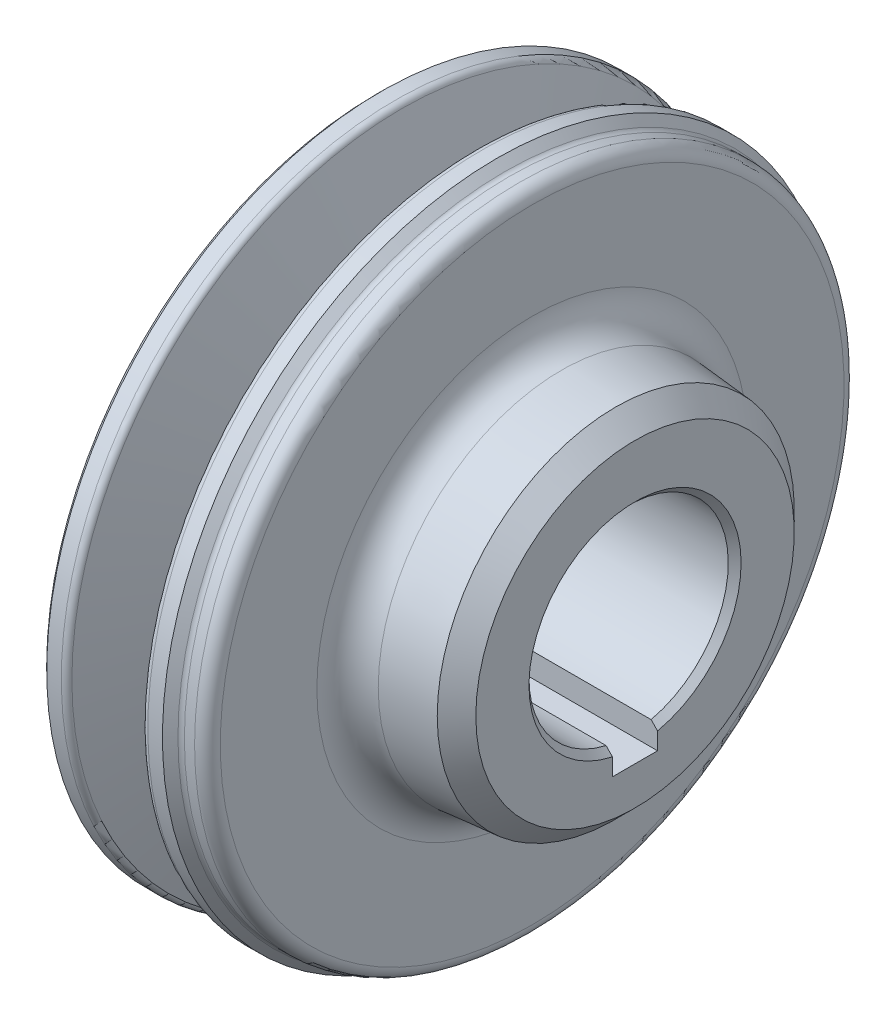
ISO-10303-21;
HEADER;
FILE_DESCRIPTION(('STEP AP214'),'2;1');
FILE_NAME('part.step','',(''),(''),'','','');
FILE_SCHEMA(('AUTOMOTIVE_DESIGN { 1 0 10303 214 1 1 1 1 }'));
ENDSEC;
DATA;
#1=APPLICATION_CONTEXT('core data for automotive mechanical design processes');
#2=APPLICATION_PROTOCOL_DEFINITION('international standard','automotive_design',2000,#1);
#3=PRODUCT_CONTEXT('',#1,'mechanical');
#4=PRODUCT('Part','Part','',(#3));
#5=PRODUCT_RELATED_PRODUCT_CATEGORY('part','',(#4));
#6=PRODUCT_DEFINITION_FORMATION('','',#4);
#7=PRODUCT_DEFINITION_CONTEXT('part definition',#1,'design');
#8=PRODUCT_DEFINITION('design','',#6,#7);
#9=PRODUCT_DEFINITION_SHAPE('','',#8);
#10=(LENGTH_UNIT() NAMED_UNIT(*) SI_UNIT(.MILLI.,.METRE.));
#11=(NAMED_UNIT(*) PLANE_ANGLE_UNIT() SI_UNIT($,.RADIAN.));
#12=(NAMED_UNIT(*) SI_UNIT($,.STERADIAN.) SOLID_ANGLE_UNIT());
#13=UNCERTAINTY_MEASURE_WITH_UNIT(LENGTH_MEASURE(1.E-05),#10,'distance_accuracy_value','');
#14=(GEOMETRIC_REPRESENTATION_CONTEXT(3) GLOBAL_UNCERTAINTY_ASSIGNED_CONTEXT((#13)) GLOBAL_UNIT_ASSIGNED_CONTEXT((#10,
#11,#12)) REPRESENTATION_CONTEXT('',''));
#15=CARTESIAN_POINT('',(0.,0.,0.));
#16=DIRECTION('',(0.,0.,1.));
#17=DIRECTION('',(1.,0.,0.));
#18=AXIS2_PLACEMENT_3D('',#15,#16,#17);
#19=CARTESIAN_POINT('',(-225.5,0.,0.));
#20=DIRECTION('',(1.,0.,0.));
#21=DIRECTION('',(0.,-1.,0.));
#22=AXIS2_PLACEMENT_3D('',#19,#20,#21);
#23=TOROIDAL_SURFACE('',#22,50.58578643763,1.);
#24=CARTESIAN_POINT('',(-226.207106781203,0.,0.));
#25=DIRECTION('',(1.,0.,0.));
#26=DIRECTION('',(0.,-1.,0.));
#27=AXIS2_PLACEMENT_3D('',#24,#25,#26);
#28=CIRCLE('',#27,51.292893218772);
#29=CARTESIAN_POINT('',(-226.207106781203,-51.292893218772,0.));
#30=VERTEX_POINT('',#29);
#31=EDGE_CURVE('E348',#30,#30,#28,.T.);
#32=ORIENTED_EDGE('',*,*,#31,.F.);
#33=EDGE_LOOP('',(#32));
#34=FACE_BOUND('',#33,.T.);
#35=CARTESIAN_POINT('',(-226.5,0.,0.));
#36=DIRECTION('',(1.,0.,0.));
#37=DIRECTION('',(0.,1.,0.));
#38=AXIS2_PLACEMENT_3D('',#35,#36,#37);
#39=CIRCLE('',#38,50.58578643763);
#40=CARTESIAN_POINT('',(-226.5,50.58578643763,0.));
#41=VERTEX_POINT('',#40);
#42=CARTESIAN_POINT('',(-226.5,-50.58578643763,0.));
#43=VERTEX_POINT('',#42);
#44=EDGE_CURVE('E355',#41,#43,#39,.T.);
#45=ORIENTED_EDGE('',*,*,#44,.T.);
#46=CARTESIAN_POINT('',(-226.5,0.,0.));
#47=DIRECTION('',(1.,0.,0.));
#48=DIRECTION('',(0.,-1.,0.));
#49=AXIS2_PLACEMENT_3D('',#46,#47,#48);
#50=CIRCLE('',#49,50.58578643763);
#51=EDGE_CURVE('E307',#43,#41,#50,.T.);
#52=ORIENTED_EDGE('',*,*,#51,.T.);
#53=EDGE_LOOP('',(#45,#52));
#54=FACE_BOUND('',#53,.T.);
#55=ADVANCED_FACE('F16',(#34,#54),#23,.T.);
#56=CARTESIAN_POINT('',(-226.5,0.,0.));
#57=DIRECTION('',(1.,0.,0.));
#58=DIRECTION('',(0.,0.,-1.));
#59=AXIS2_PLACEMENT_3D('',#56,#57,#58);
#60=PLANE('',#59);
#61=CARTESIAN_POINT('',(-226.5,0.,0.));
#62=DIRECTION('',(-1.,0.,0.));
#63=DIRECTION('',(0.,-1.,0.));
#64=AXIS2_PLACEMENT_3D('',#61,#62,#63);
#65=CIRCLE('',#64,46.91491496572);
#66=CARTESIAN_POINT('',(-226.5,-46.91491496572,0.));
#67=VERTEX_POINT('',#66);
#68=CARTESIAN_POINT('',(-226.5,46.91491496572,0.));
#69=VERTEX_POINT('',#68);
#70=EDGE_CURVE('E302',#67,#69,#65,.T.);
#71=ORIENTED_EDGE('',*,*,#70,.F.);
#72=CARTESIAN_POINT('',(-226.5,0.,0.));
#73=DIRECTION('',(-1.,0.,0.));
#74=DIRECTION('',(0.,1.,0.));
#75=AXIS2_PLACEMENT_3D('',#72,#73,#74);
#76=CIRCLE('',#75,46.91491496572);
#77=EDGE_CURVE('E273',#69,#67,#76,.T.);
#78=ORIENTED_EDGE('',*,*,#77,.F.);
#79=EDGE_LOOP('',(#71,#78));
#80=FACE_BOUND('',#79,.T.);
#81=ORIENTED_EDGE('',*,*,#51,.F.);
#82=ORIENTED_EDGE('',*,*,#44,.F.);
#83=EDGE_LOOP('',(#81,#82));
#84=FACE_BOUND('',#83,.T.);
#85=ADVANCED_FACE('F312',(#80,#84),#60,.F.);
#86=CARTESIAN_POINT('',(-225.499999999954,0.,0.));
#87=DIRECTION('',(1.,0.,0.));
#88=DIRECTION('',(0.,0.,-1.));
#89=AXIS2_PLACEMENT_3D('',#86,#87,#88);
#90=CONICAL_SURFACE('',#89,52.0000000000209,0.785398163357254);
#91=CARTESIAN_POINT('',(-225.5,0.,0.));
#92=DIRECTION('',(1.,0.,0.));
#93=DIRECTION('',(0.,0.,-1.));
#94=AXIS2_PLACEMENT_3D('',#91,#92,#93);
#95=CIRCLE('',#94,52.);
#96=CARTESIAN_POINT('',(-225.5,0.,-52.));
#97=VERTEX_POINT('',#96);
#98=EDGE_CURVE('E299',#97,#97,#95,.T.);
#99=ORIENTED_EDGE('',*,*,#98,.F.);
#100=EDGE_LOOP('',(#99));
#101=FACE_BOUND('',#100,.T.);
#102=ORIENTED_EDGE('',*,*,#31,.T.);
#103=EDGE_LOOP('',(#102));
#104=FACE_BOUND('',#103,.T.);
#105=ADVANCED_FACE('F290',(#101,#104),#90,.T.);
#106=CARTESIAN_POINT('',(-225.5,0.,0.));
#107=DIRECTION('',(1.,0.,0.));
#108=DIRECTION('',(0.,-1.,0.));
#109=AXIS2_PLACEMENT_3D('',#106,#107,#108);
#110=TOROIDAL_SURFACE('',#109,46.91491496572,1.);
#111=ORIENTED_EDGE('',*,*,#77,.T.);
#112=ORIENTED_EDGE('',*,*,#70,.T.);
#113=EDGE_LOOP('',(#111,#112));
#114=FACE_BOUND('',#113,.T.);
#115=CARTESIAN_POINT('',(-225.736471925201,0.,0.));
#116=DIRECTION('',(1.,0.,0.));
#117=DIRECTION('',(0.,-1.,0.));
#118=AXIS2_PLACEMENT_3D('',#115,#116,#117);
#119=CIRCLE('',#118,45.9432766438079);
#120=CARTESIAN_POINT('',(-225.736471925201,-45.9432766438079,0.));
#121=VERTEX_POINT('',#120);
#122=EDGE_CURVE('E297',#121,#121,#119,.T.);
#123=ORIENTED_EDGE('',*,*,#122,.T.);
#124=EDGE_LOOP('',(#123));
#125=FACE_BOUND('',#124,.T.);
#126=ADVANCED_FACE('F278',(#114,#125),#110,.T.);
#127=CARTESIAN_POINT('',(-228.525,0.,0.));
#128=DIRECTION('',(1.,0.,0.));
#129=DIRECTION('',(0.,0.,-1.));
#130=AXIS2_PLACEMENT_3D('',#127,#128,#129);
#131=CYLINDRICAL_SURFACE('',#130,52.);
#132=CARTESIAN_POINT('',(-223.226542528,0.,0.));
#133=DIRECTION('',(1.,0.,0.));
#134=DIRECTION('',(0.,-1.,0.));
#135=AXIS2_PLACEMENT_3D('',#132,#133,#134);
#136=CIRCLE('',#135,52.);
#137=CARTESIAN_POINT('',(-223.226542528,-52.,0.));
#138=VERTEX_POINT('',#137);
#139=EDGE_CURVE('E718',#138,#138,#136,.T.);
#140=ORIENTED_EDGE('',*,*,#139,.F.);
#141=EDGE_LOOP('',(#140));
#142=FACE_BOUND('',#141,.T.);
#143=ORIENTED_EDGE('',*,*,#98,.T.);
#144=EDGE_LOOP('',(#143));
#145=FACE_BOUND('',#144,.T.);
#146=ADVANCED_FACE('F289',(#142,#145),#131,.T.);
#147=CARTESIAN_POINT('',(-226.2094157756,0.,0.));
#148=DIRECTION('',(1.,0.,0.));
#149=DIRECTION('',(0.,-1.,0.));
#150=AXIS2_PLACEMENT_3D('',#147,#148,#149);
#151=TOROIDAL_SURFACE('',#150,44.,2.);
#152=ORIENTED_EDGE('',*,*,#122,.F.);
#153=EDGE_LOOP('',(#152));
#154=FACE_BOUND('',#153,.T.);
#155=CARTESIAN_POINT('',(-224.307302742943,0.,0.));
#156=DIRECTION('',(-1.,0.,0.));
#157=DIRECTION('',(0.,1.,0.));
#158=AXIS2_PLACEMENT_3D('',#155,#156,#157);
#159=CIRCLE('',#158,44.6180339887974);
#160=CARTESIAN_POINT('',(-224.307302742943,44.6180339887974,0.));
#161=VERTEX_POINT('',#160);
#162=EDGE_CURVE('E720',#161,#161,#159,.F.);
#163=ORIENTED_EDGE('',*,*,#162,.T.);
#164=EDGE_LOOP('',(#163));
#165=FACE_BOUND('',#164,.T.);
#166=ADVANCED_FACE('F654',(#154,#165),#151,.F.);
#167=CARTESIAN_POINT('',(-223.226542528,0.,0.));
#168=DIRECTION('',(1.,0.,0.));
#169=DIRECTION('',(0.,-1.,0.));
#170=AXIS2_PLACEMENT_3D('',#167,#168,#169);
#171=TOROIDAL_SURFACE('',#170,51.,1.);
#172=CARTESIAN_POINT('',(-222.275486011711,0.,0.));
#173=DIRECTION('',(-1.,0.,0.));
#174=DIRECTION('',(0.,1.,0.));
#175=AXIS2_PLACEMENT_3D('',#172,#173,#174);
#176=CIRCLE('',#175,51.3090169943666);
#177=CARTESIAN_POINT('',(-222.275486011711,51.3090169943666,0.));
#178=VERTEX_POINT('',#177);
#179=EDGE_CURVE('E722',#178,#178,#176,.F.);
#180=ORIENTED_EDGE('',*,*,#179,.F.);
#181=EDGE_LOOP('',(#180));
#182=FACE_BOUND('',#181,.T.);
#183=ORIENTED_EDGE('',*,*,#139,.T.);
#184=EDGE_LOOP('',(#183));
#185=FACE_BOUND('',#184,.T.);
#186=ADVANCED_FACE('F645',(#182,#185),#171,.T.);
#187=CARTESIAN_POINT('',(-224.307302742943,0.,0.));
#188=DIRECTION('',(-1.,0.,0.));
#189=DIRECTION('',(0.,0.,1.));
#190=AXIS2_PLACEMENT_3D('',#187,#188,#189);
#191=CONICAL_SURFACE('',#190,44.6180339887974,1.25663706143445);
#192=ORIENTED_EDGE('',*,*,#162,.F.);
#193=EDGE_LOOP('',(#192));
#194=FACE_BOUND('',#193,.T.);
#195=CARTESIAN_POINT('',(-222.188909291274,0.,0.));
#196=DIRECTION('',(1.,0.,0.));
#197=DIRECTION('',(0.,-1.,0.));
#198=AXIS2_PLACEMENT_3D('',#195,#196,#197);
#199=CIRCLE('',#198,38.0982893372086);
#200=CARTESIAN_POINT('',(-222.188909291274,-38.0982893372086,0.));
#201=VERTEX_POINT('',#200);
#202=EDGE_CURVE('E732',#201,#201,#199,.F.);
#203=ORIENTED_EDGE('',*,*,#202,.F.);
#204=EDGE_LOOP('',(#203));
#205=FACE_BOUND('',#204,.T.);
#206=ADVANCED_FACE('F636',(#194,#205),#191,.F.);
#207=CARTESIAN_POINT('',(-222.275486011711,0.,0.));
#208=DIRECTION('',(-1.,0.,0.));
#209=DIRECTION('',(0.,0.,1.));
#210=AXIS2_PLACEMENT_3D('',#207,#208,#209);
#211=CONICAL_SURFACE('',#210,51.3090169943666,1.25663706143518);
#212=CARTESIAN_POINT('',(-218.4385037971,0.,0.));
#213=DIRECTION('',(1.,0.,0.));
#214=DIRECTION('',(0.,0.,-1.));
#215=AXIS2_PLACEMENT_3D('',#212,#213,#214);
#216=CIRCLE('',#215,39.5);
#217=CARTESIAN_POINT('',(-218.4385037971,0.,-39.5));
#218=VERTEX_POINT('',#217);
#219=EDGE_CURVE('E735',#218,#218,#216,.T.);
#220=ORIENTED_EDGE('',*,*,#219,.F.);
#221=EDGE_LOOP('',(#220));
#222=FACE_BOUND('',#221,.T.);
#223=ORIENTED_EDGE('',*,*,#179,.T.);
#224=EDGE_LOOP('',(#223));
#225=FACE_BOUND('',#224,.T.);
#226=ADVANCED_FACE('F627',(#222,#225),#211,.T.);
#227=CARTESIAN_POINT('',(-216.4825701935,0.,0.));
#228=DIRECTION('',(1.,0.,0.));
#229=DIRECTION('',(0.,-1.,0.));
#230=AXIS2_PLACEMENT_3D('',#227,#228,#229);
#231=TOROIDAL_SURFACE('',#230,39.95239130345,6.);
#232=ORIENTED_EDGE('',*,*,#202,.T.);
#233=EDGE_LOOP('',(#232));
#234=FACE_BOUND('',#233,.T.);
#235=CARTESIAN_POINT('',(-218.03548446411,0.,0.));
#236=DIRECTION('',(-1.,0.,0.));
#237=DIRECTION('',(0.,1.,0.));
#238=AXIS2_PLACEMENT_3D('',#235,#236,#237);
#239=CIRCLE('',#238,34.1568363457156);
#240=CARTESIAN_POINT('',(-218.03548446411,34.1568363457156,0.));
#241=VERTEX_POINT('',#240);
#242=EDGE_CURVE('E738',#241,#241,#239,.F.);
#243=ORIENTED_EDGE('',*,*,#242,.T.);
#244=EDGE_LOOP('',(#243));
#245=FACE_BOUND('',#244,.T.);
#246=ADVANCED_FACE('F618',(#234,#245),#231,.T.);
#247=CARTESIAN_POINT('',(-228.525,0.,0.));
#248=DIRECTION('',(1.,0.,0.));
#249=DIRECTION('',(0.,0.,-1.));
#250=AXIS2_PLACEMENT_3D('',#247,#248,#249);
#251=CYLINDRICAL_SURFACE('',#250,39.5);
#252=CARTESIAN_POINT('',(-214.561496202919,0.,0.));
#253=DIRECTION('',(1.,0.,0.));
#254=DIRECTION('',(0.,-1.,0.));
#255=AXIS2_PLACEMENT_3D('',#252,#253,#254);
#256=CIRCLE('',#255,39.4999999999754);
#257=CARTESIAN_POINT('',(-214.561496202919,-39.4999999999754,0.));
#258=VERTEX_POINT('',#257);
#259=EDGE_CURVE('E743',#258,#258,#256,.T.);
#260=ORIENTED_EDGE('',*,*,#259,.F.);
#261=EDGE_LOOP('',(#260));
#262=FACE_BOUND('',#261,.T.);
#263=ORIENTED_EDGE('',*,*,#219,.T.);
#264=EDGE_LOOP('',(#263));
#265=FACE_BOUND('',#264,.T.);
#266=ADVANCED_FACE('F609',(#262,#265),#251,.T.);
#267=CARTESIAN_POINT('',(-218.03548446394,0.,0.));
#268=DIRECTION('',(-1.,0.,0.));
#269=DIRECTION('',(0.,0.,1.));
#270=AXIS2_PLACEMENT_3D('',#267,#268,#269);
#271=CONICAL_SURFACE('',#270,34.1568363456588,0.261799387794793);
#272=ORIENTED_EDGE('',*,*,#242,.F.);
#273=EDGE_LOOP('',(#272));
#274=FACE_BOUND('',#273,.T.);
#275=CARTESIAN_POINT('',(-214.8757496513,0.,0.));
#276=DIRECTION('',(1.,0.,0.));
#277=DIRECTION('',(0.,-1.,0.));
#278=AXIS2_PLACEMENT_3D('',#275,#276,#277);
#279=CIRCLE('',#278,33.3101879543195);
#280=CARTESIAN_POINT('',(-214.8757496513,-33.3101879543195,0.));
#281=VERTEX_POINT('',#280);
#282=EDGE_CURVE('E103',#281,#281,#279,.T.);
#283=ORIENTED_EDGE('',*,*,#282,.T.);
#284=EDGE_LOOP('',(#283));
#285=FACE_BOUND('',#284,.T.);
#286=ADVANCED_FACE('F601',(#274,#285),#271,.F.);
#287=CARTESIAN_POINT('',(-210.724513988282,0.,0.));
#288=DIRECTION('',(1.,0.,0.));
#289=DIRECTION('',(0.,0.,-1.));
#290=AXIS2_PLACEMENT_3D('',#287,#288,#289);
#291=CONICAL_SURFACE('',#290,51.3090169943666,1.25663706143518);
#292=CARTESIAN_POINT('',(-210.724513988297,0.,0.));
#293=DIRECTION('',(1.,0.,0.));
#294=DIRECTION('',(0.,-1.,0.));
#295=AXIS2_PLACEMENT_3D('',#292,#293,#294);
#296=CIRCLE('',#295,51.309016994369);
#297=CARTESIAN_POINT('',(-210.724513988297,-51.309016994369,0.));
#298=VERTEX_POINT('',#297);
#299=EDGE_CURVE('E129',#298,#298,#296,.T.);
#300=ORIENTED_EDGE('',*,*,#299,.F.);
#301=EDGE_LOOP('',(#300));
#302=FACE_BOUND('',#301,.T.);
#303=ORIENTED_EDGE('',*,*,#259,.T.);
#304=EDGE_LOOP('',(#303));
#305=FACE_BOUND('',#304,.T.);
#306=ADVANCED_FACE('F593',(#302,#305),#291,.T.);
#307=CARTESIAN_POINT('',(-215.7053571204,0.,0.));
#308=DIRECTION('',(1.,0.,0.));
#309=DIRECTION('',(0.,-1.,0.));
#310=AXIS2_PLACEMENT_3D('',#307,#308,#309);
#311=TOROIDAL_SURFACE('',#310,30.21405072928,3.205357120363);
#312=ORIENTED_EDGE('',*,*,#282,.F.);
#313=EDGE_LOOP('',(#312));
#314=FACE_BOUND('',#313,.T.);
#315=CARTESIAN_POINT('',(-214.,0.,0.));
#316=DIRECTION('',(1.,0.,0.));
#317=DIRECTION('',(0.,0.,-1.));
#318=AXIS2_PLACEMENT_3D('',#315,#316,#317);
#319=CIRCLE('',#318,27.5000000000263);
#320=CARTESIAN_POINT('',(-214.,0.,-27.5000000000263));
#321=VERTEX_POINT('',#320);
#322=EDGE_CURVE('E111',#321,#321,#319,.T.);
#323=ORIENTED_EDGE('',*,*,#322,.T.);
#324=EDGE_LOOP('',(#323));
#325=FACE_BOUND('',#324,.T.);
#326=ADVANCED_FACE('F147',(#314,#325),#311,.F.);
#327=CARTESIAN_POINT('',(-213.999999999999,0.,0.));
#328=DIRECTION('',(-1.,0.,0.));
#329=DIRECTION('',(0.,0.,1.));
#330=AXIS2_PLACEMENT_3D('',#327,#328,#329);
#331=CONICAL_SURFACE('',#330,15.9999999999627,0.785398163454292);
#332=CARTESIAN_POINT('',(-213.999999999999,0.,0.));
#333=DIRECTION('',(-1.,0.,0.));
#334=DIRECTION('',(0.,0.,1.));
#335=AXIS2_PLACEMENT_3D('',#332,#333,#334);
#336=CIRCLE('',#335,15.9999999999627);
#337=CARTESIAN_POINT('',(-214.000000000003,-15.6124949959626,3.5));
#338=VERTEX_POINT('',#337);
#339=CARTESIAN_POINT('',(-214.000000000003,-15.6124949959626,-3.5));
#340=VERTEX_POINT('',#339);
#341=EDGE_CURVE('E106',#338,#340,#336,.T.);
#342=ORIENTED_EDGE('',*,*,#341,.T.);
#343=CARTESIAN_POINT('',(-213.500000000021,-15.0996688704855,-3.50000000001439));
#344=CARTESIAN_POINT('',(-213.583298096368,-15.185174247195,-3.50000000000719));
#345=CARTESIAN_POINT('',(-213.666613811236,-15.2706624460353,-3.5000000000024));
#346=CARTESIAN_POINT('',(-213.833280477898,-15.4416044878625,-3.4999999999976));
#347=CARTESIAN_POINT('',(-213.916631429693,-15.5270583308495,-3.4999999999976));
#348=CARTESIAN_POINT('',(-214.000000000008,-15.6124949959673,-3.5));
#349=B_SPLINE_CURVE_WITH_KNOTS('',3,(#343,#344,#345,#346,#347,#348),.UNSPECIFIED.,.F.,.F.,(4,2,
4),(0.,0.358116830606035,0.71623366072898),.UNSPECIFIED.);
#350=CARTESIAN_POINT('',(-213.500000000015,-15.0996688705085,-3.5));
#351=VERTEX_POINT('',#350);
#352=EDGE_CURVE('E91',#351,#340,#349,.T.);
#353=ORIENTED_EDGE('',*,*,#352,.F.);
#354=CARTESIAN_POINT('',(-213.5,0.,0.));
#355=DIRECTION('',(1.,0.,0.));
#356=DIRECTION('',(0.,0.,-1.));
#357=AXIS2_PLACEMENT_3D('',#354,#355,#356);
#358=CIRCLE('',#357,15.5);
#359=CARTESIAN_POINT('',(-213.500000000015,-15.0996688705085,3.5));
#360=VERTEX_POINT('',#359);
#361=EDGE_CURVE('E127',#351,#360,#358,.T.);
#362=ORIENTED_EDGE('',*,*,#361,.T.);
#363=CARTESIAN_POINT('',(-214.000000000006,-15.6124949959697,3.50000000000396));
#364=CARTESIAN_POINT('',(-213.91663142969,-15.5270583308521,3.50000000000198));
#365=CARTESIAN_POINT('',(-213.833280477896,-15.4416044878644,3.50000000000066));
#366=CARTESIAN_POINT('',(-213.666613811237,-15.2706624460335,3.49999999999934));
#367=CARTESIAN_POINT('',(-213.583298096373,-15.1851742471903,3.49999999999934));
#368=CARTESIAN_POINT('',(-213.50000000003,-15.099668870477,3.5));
#369=B_SPLINE_CURVE_WITH_KNOTS('',3,(#363,#364,#365,#366,#367,#368),.UNSPECIFIED.,.F.,.F.,(4,2,
4),(0.,0.358116830122938,0.716233660728972),.UNSPECIFIED.);
#370=EDGE_CURVE('E102',#338,#360,#369,.T.);
#371=ORIENTED_EDGE('',*,*,#370,.F.);
#372=EDGE_LOOP('',(#342,#353,#362,#371));
#373=FACE_BOUND('',#372,.T.);
#374=ADVANCED_FACE('F107',(#373),#331,.F.);
#375=CARTESIAN_POINT('',(-209.773457472,0.,0.));
#376=DIRECTION('',(1.,0.,0.));
#377=DIRECTION('',(0.,-1.,0.));
#378=AXIS2_PLACEMENT_3D('',#375,#376,#377);
#379=TOROIDAL_SURFACE('',#378,51.,1.);
#380=CARTESIAN_POINT('',(-209.773457472,0.,0.));
#381=DIRECTION('',(1.,0.,0.));
#382=DIRECTION('',(0.,0.,-1.));
#383=AXIS2_PLACEMENT_3D('',#380,#381,#382);
#384=CIRCLE('',#383,52.);
#385=CARTESIAN_POINT('',(-209.773457472,0.,-52.));
#386=VERTEX_POINT('',#385);
#387=EDGE_CURVE('E110',#386,#386,#384,.T.);
#388=ORIENTED_EDGE('',*,*,#387,.F.);
#389=EDGE_LOOP('',(#388));
#390=FACE_BOUND('',#389,.T.);
#391=ORIENTED_EDGE('',*,*,#299,.T.);
#392=EDGE_LOOP('',(#391));
#393=FACE_BOUND('',#392,.T.);
#394=ADVANCED_FACE('F137',(#390,#393),#379,.T.);
#395=CARTESIAN_POINT('',(-228.525,0.,0.));
#396=DIRECTION('',(1.,0.,0.));
#397=DIRECTION('',(0.,0.,-1.));
#398=AXIS2_PLACEMENT_3D('',#395,#396,#397);
#399=CYLINDRICAL_SURFACE('',#398,15.5);
#400=ORIENTED_EDGE('',*,*,#361,.F.);
#401=DIRECTION('',(-1.,0.,0.));
#402=VECTOR('',#401,1.);
#403=CARTESIAN_POINT('',(-186.,-15.09966887054,-3.5));
#404=LINE('',#403,#402);
#405=CARTESIAN_POINT('',(-187.000000000057,-15.0996688705277,-3.5));
#406=VERTEX_POINT('',#405);
#407=EDGE_CURVE('E101',#351,#406,#404,.F.);
#408=ORIENTED_EDGE('',*,*,#407,.T.);
#409=CARTESIAN_POINT('',(-187.000000000069,0.,0.));
#410=DIRECTION('',(1.,0.,0.));
#411=DIRECTION('',(0.,-1.,0.));
#412=AXIS2_PLACEMENT_3D('',#409,#410,#411);
#413=CIRCLE('',#412,15.4999999999745);
#414=CARTESIAN_POINT('',(-187.000000000054,-15.0996688705309,3.5));
#415=VERTEX_POINT('',#414);
#416=EDGE_CURVE('E117',#406,#415,#413,.T.);
#417=ORIENTED_EDGE('',*,*,#416,.T.);
#418=DIRECTION('',(1.,0.,0.));
#419=VECTOR('',#418,1.);
#420=CARTESIAN_POINT('',(-186.,-15.09966887054,3.5));
#421=LINE('',#420,#419);
#422=EDGE_CURVE('E124',#415,#360,#421,.F.);
#423=ORIENTED_EDGE('',*,*,#422,.T.);
#424=EDGE_LOOP('',(#400,#408,#417,#423));
#425=FACE_BOUND('',#424,.T.);
#426=ADVANCED_FACE('F141',(#425),#399,.F.);
#427=CARTESIAN_POINT('',(-214.,0.,0.));
#428=DIRECTION('',(1.,0.,0.));
#429=DIRECTION('',(0.,0.,-1.));
#430=AXIS2_PLACEMENT_3D('',#427,#428,#429);
#431=PLANE('',#430);
#432=DIRECTION('',(0.,1.,0.));
#433=VECTOR('',#432,1.);
#434=CARTESIAN_POINT('',(-214.,-18.8,-3.5));
#435=LINE('',#434,#433);
#436=CARTESIAN_POINT('',(-214.,-18.8,-3.5));
#437=VERTEX_POINT('',#436);
#438=EDGE_CURVE('E98',#437,#340,#435,.T.);
#439=ORIENTED_EDGE('',*,*,#438,.T.);
#440=ORIENTED_EDGE('',*,*,#341,.F.);
#441=DIRECTION('',(0.,1.,0.));
#442=VECTOR('',#441,1.);
#443=CARTESIAN_POINT('',(-214.,0.,3.5));
#444=LINE('',#443,#442);
#445=CARTESIAN_POINT('',(-214.,-18.8,3.5));
#446=VERTEX_POINT('',#445);
#447=EDGE_CURVE('E386',#338,#446,#444,.F.);
#448=ORIENTED_EDGE('',*,*,#447,.T.);
#449=DIRECTION('',(0.,0.,-1.));
#450=VECTOR('',#449,1.);
#451=CARTESIAN_POINT('',(-214.,-18.8,3.5));
#452=LINE('',#451,#450);
#453=EDGE_CURVE('E116',#446,#437,#452,.T.);
#454=ORIENTED_EDGE('',*,*,#453,.T.);
#455=EDGE_LOOP('',(#439,#440,#448,#454));
#456=FACE_BOUND('',#455,.T.);
#457=ORIENTED_EDGE('',*,*,#322,.F.);
#458=EDGE_LOOP('',(#457));
#459=FACE_BOUND('',#458,.T.);
#460=ADVANCED_FACE('F113',(#456,#459),#431,.F.);
#461=CARTESIAN_POINT('',(-228.525,0.,0.));
#462=DIRECTION('',(1.,0.,0.));
#463=DIRECTION('',(0.,0.,-1.));
#464=AXIS2_PLACEMENT_3D('',#461,#462,#463);
#465=CYLINDRICAL_SURFACE('',#464,52.);
#466=CARTESIAN_POINT('',(-207.499999999982,0.,0.));
#467=DIRECTION('',(-1.,0.,0.));
#468=DIRECTION('',(0.,1.,0.));
#469=AXIS2_PLACEMENT_3D('',#466,#467,#468);
#470=CIRCLE('',#469,51.9999999999641);
#471=CARTESIAN_POINT('',(-207.499999999982,51.9999999999641,0.));
#472=VERTEX_POINT('',#471);
#473=EDGE_CURVE('E375',#472,#472,#470,.F.);
#474=ORIENTED_EDGE('',*,*,#473,.F.);
#475=EDGE_LOOP('',(#474));
#476=FACE_BOUND('',#475,.T.);
#477=ORIENTED_EDGE('',*,*,#387,.T.);
#478=EDGE_LOOP('',(#477));
#479=FACE_BOUND('',#478,.T.);
#480=ADVANCED_FACE('F185',(#476,#479),#465,.T.);
#481=CARTESIAN_POINT('',(-186.000000000035,0.,0.));
#482=DIRECTION('',(1.,0.,0.));
#483=DIRECTION('',(0.,0.,-1.));
#484=AXIS2_PLACEMENT_3D('',#481,#482,#483);
#485=CONICAL_SURFACE('',#484,16.5000000000077,0.785398163397448);
#486=ORIENTED_EDGE('',*,*,#416,.F.);
#487=CARTESIAN_POINT('',(-187.000000000038,-15.0996688705465,-3.5));
#488=CARTESIAN_POINT('',(-186.833467564717,-15.2706076201783,-3.5));
#489=CARTESIAN_POINT('',(-186.66686801332,-15.4414808809119,-3.5));
#490=CARTESIAN_POINT('',(-186.33353467998,-15.7830964229342,-3.5));
#491=CARTESIAN_POINT('',(-186.16680089804,-15.9538387042242,-3.5));
#492=CARTESIAN_POINT('',(-186.000000000024,-16.1245154966171,-3.5));
#493=B_SPLINE_CURVE_WITH_KNOTS('',3,(#487,#488,#489,#490,#491,#492),.UNSPECIFIED.,.F.,.F.,(4,2,
4),(0.,0.715945344168185,1.43189068142751),.UNSPECIFIED.);
#494=CARTESIAN_POINT('',(-186.00000000003,-16.1245154966111,-3.5));
#495=VERTEX_POINT('',#494);
#496=EDGE_CURVE('E119',#406,#495,#493,.T.);
#497=ORIENTED_EDGE('',*,*,#496,.T.);
#498=CARTESIAN_POINT('',(-186.000000000035,0.,0.));
#499=DIRECTION('',(1.,0.,0.));
#500=DIRECTION('',(0.,0.,-1.));
#501=AXIS2_PLACEMENT_3D('',#498,#499,#500);
#502=CIRCLE('',#501,16.5000000000077);
#503=CARTESIAN_POINT('',(-186.00000000003,-16.1245154966111,3.5));
#504=VERTEX_POINT('',#503);
#505=EDGE_CURVE('E372',#504,#495,#502,.F.);
#506=ORIENTED_EDGE('',*,*,#505,.F.);
#507=CARTESIAN_POINT('',(-186.000000000024,-16.1245154966171,3.5));
#508=CARTESIAN_POINT('',(-186.16680089804,-15.9538387042242,3.5));
#509=CARTESIAN_POINT('',(-186.33353467998,-15.7830964229342,3.5));
#510=CARTESIAN_POINT('',(-186.66686801332,-15.4414808809119,3.5));
#511=CARTESIAN_POINT('',(-186.833467564717,-15.2706076201783,3.5));
#512=CARTESIAN_POINT('',(-187.000000000038,-15.0996688705465,3.5));
#513=B_SPLINE_CURVE_WITH_KNOTS('',3,(#507,#508,#509,#510,#511,#512),.UNSPECIFIED.,.F.,.F.,(4,2,
4),(0.,0.715945337259333,1.43189068142752),.UNSPECIFIED.);
#514=EDGE_CURVE('E176',#504,#415,#513,.T.);
#515=ORIENTED_EDGE('',*,*,#514,.T.);
#516=EDGE_LOOP('',(#486,#497,#506,#515));
#517=FACE_BOUND('',#516,.T.);
#518=ADVANCED_FACE('F167',(#517),#485,.F.);
#519=CARTESIAN_POINT('',(-186.,-18.8,-3.5));
#520=DIRECTION('',(0.,0.,-1.));
#521=DIRECTION('',(-1.,0.,0.));
#522=AXIS2_PLACEMENT_3D('',#519,#520,#521);
#523=PLANE('',#522);
#524=ORIENTED_EDGE('',*,*,#407,.F.);
#525=ORIENTED_EDGE('',*,*,#352,.T.);
#526=ORIENTED_EDGE('',*,*,#438,.F.);
#527=DIRECTION('',(1.,0.,0.));
#528=VECTOR('',#527,1.);
#529=CARTESIAN_POINT('',(-186.,-18.8,-3.5));
#530=LINE('',#529,#528);
#531=CARTESIAN_POINT('',(-186.,-18.8,-3.5));
#532=VERTEX_POINT('',#531);
#533=EDGE_CURVE('E393',#437,#532,#530,.T.);
#534=ORIENTED_EDGE('',*,*,#533,.T.);
#535=DIRECTION('',(0.,1.,0.));
#536=VECTOR('',#535,1.);
#537=CARTESIAN_POINT('',(-186.,0.,-3.5));
#538=LINE('',#537,#536);
#539=EDGE_CURVE('E374',#495,#532,#538,.F.);
#540=ORIENTED_EDGE('',*,*,#539,.F.);
#541=ORIENTED_EDGE('',*,*,#496,.F.);
#542=EDGE_LOOP('',(#524,#525,#526,#534,#540,#541));
#543=FACE_BOUND('',#542,.T.);
#544=ADVANCED_FACE('F96',(#543),#523,.F.);
#545=CARTESIAN_POINT('',(-186.,-18.8,3.5));
#546=DIRECTION('',(0.,-1.,0.));
#547=DIRECTION('',(0.,0.,-1.));
#548=AXIS2_PLACEMENT_3D('',#545,#546,#547);
#549=PLANE('',#548);
#550=ORIENTED_EDGE('',*,*,#453,.F.);
#551=DIRECTION('',(1.,0.,0.));
#552=VECTOR('',#551,1.);
#553=CARTESIAN_POINT('',(-186.,-18.8,3.5));
#554=LINE('',#553,#552);
#555=CARTESIAN_POINT('',(-186.,-18.8,3.5));
#556=VERTEX_POINT('',#555);
#557=EDGE_CURVE('E382',#446,#556,#554,.T.);
#558=ORIENTED_EDGE('',*,*,#557,.T.);
#559=DIRECTION('',(0.,0.,-1.));
#560=VECTOR('',#559,1.);
#561=CARTESIAN_POINT('',(-186.,-18.8,0.));
#562=LINE('',#561,#560);
#563=EDGE_CURVE('E379',#532,#556,#562,.F.);
#564=ORIENTED_EDGE('',*,*,#563,.F.);
#565=ORIENTED_EDGE('',*,*,#533,.F.);
#566=EDGE_LOOP('',(#550,#558,#564,#565));
#567=FACE_BOUND('',#566,.T.);
#568=ADVANCED_FACE('F166',(#567),#549,.F.);
#569=CARTESIAN_POINT('',(-186.,0.,3.5));
#570=DIRECTION('',(0.,0.,1.));
#571=DIRECTION('',(1.,0.,0.));
#572=AXIS2_PLACEMENT_3D('',#569,#570,#571);
#573=PLANE('',#572);
#574=ORIENTED_EDGE('',*,*,#447,.F.);
#575=ORIENTED_EDGE('',*,*,#370,.T.);
#576=ORIENTED_EDGE('',*,*,#422,.F.);
#577=ORIENTED_EDGE('',*,*,#514,.F.);
#578=DIRECTION('',(0.,1.,0.));
#579=VECTOR('',#578,1.);
#580=CARTESIAN_POINT('',(-186.,0.,3.5));
#581=LINE('',#580,#579);
#582=EDGE_CURVE('E411',#556,#504,#581,.T.);
#583=ORIENTED_EDGE('',*,*,#582,.F.);
#584=ORIENTED_EDGE('',*,*,#557,.F.);
#585=EDGE_LOOP('',(#574,#575,#576,#577,#583,#584));
#586=FACE_BOUND('',#585,.T.);
#587=ADVANCED_FACE('F436',(#586),#573,.F.);
#588=CARTESIAN_POINT('',(-207.499999999982,0.,0.));
#589=DIRECTION('',(-1.,0.,0.));
#590=DIRECTION('',(0.,0.,1.));
#591=AXIS2_PLACEMENT_3D('',#588,#589,#590);
#592=CONICAL_SURFACE('',#591,51.9999999999641,0.785398163373903);
#593=CARTESIAN_POINT('',(-206.292893218792,0.,0.));
#594=DIRECTION('',(1.,0.,0.));
#595=DIRECTION('',(0.,-1.,0.));
#596=AXIS2_PLACEMENT_3D('',#593,#594,#595);
#597=CIRCLE('',#596,50.7928932188185);
#598=CARTESIAN_POINT('',(-206.292893218792,-50.7928932188185,0.));
#599=VERTEX_POINT('',#598);
#600=EDGE_CURVE('E371',#599,#599,#597,.F.);
#601=ORIENTED_EDGE('',*,*,#600,.T.);
#602=EDGE_LOOP('',(#601));
#603=FACE_BOUND('',#602,.T.);
#604=ORIENTED_EDGE('',*,*,#473,.T.);
#605=EDGE_LOOP('',(#604));
#606=FACE_BOUND('',#605,.T.);
#607=ADVANCED_FACE('F434',(#603,#606),#592,.T.);
#608=CARTESIAN_POINT('',(-186.,0.,0.));
#609=DIRECTION('',(1.,0.,0.));
#610=DIRECTION('',(0.,0.,-1.));
#611=AXIS2_PLACEMENT_3D('',#608,#609,#610);
#612=PLANE('',#611);
#613=ORIENTED_EDGE('',*,*,#563,.T.);
#614=ORIENTED_EDGE('',*,*,#582,.T.);
#615=ORIENTED_EDGE('',*,*,#505,.T.);
#616=ORIENTED_EDGE('',*,*,#539,.T.);
#617=EDGE_LOOP('',(#613,#614,#615,#616));
#618=FACE_BOUND('',#617,.T.);
#619=CARTESIAN_POINT('',(-185.999999999979,0.,0.));
#620=DIRECTION('',(-1.,0.,0.));
#621=DIRECTION('',(0.,0.,1.));
#622=AXIS2_PLACEMENT_3D('',#619,#620,#621);
#623=CIRCLE('',#622,24.7624659905341);
#624=CARTESIAN_POINT('',(-185.999999999979,0.,24.7624659905341));
#625=VERTEX_POINT('',#624);
#626=EDGE_CURVE('E363',#625,#625,#623,.T.);
#627=ORIENTED_EDGE('',*,*,#626,.F.);
#628=EDGE_LOOP('',(#627));
#629=FACE_BOUND('',#628,.T.);
#630=ADVANCED_FACE('F430',(#618,#629),#612,.T.);
#631=CARTESIAN_POINT('',(-205.5857864376,0.,0.));
#632=DIRECTION('',(1.,0.,0.));
#633=DIRECTION('',(0.,-1.,0.));
#634=AXIS2_PLACEMENT_3D('',#631,#632,#633);
#635=TOROIDAL_SURFACE('',#634,51.5,1.);
#636=CARTESIAN_POINT('',(-205.5857864376,0.,0.));
#637=DIRECTION('',(1.,0.,0.));
#638=DIRECTION('',(0.,0.,-1.));
#639=AXIS2_PLACEMENT_3D('',#636,#637,#638);
#640=CIRCLE('',#639,50.5);
#641=CARTESIAN_POINT('',(-205.5857864376,0.,-50.5));
#642=VERTEX_POINT('',#641);
#643=EDGE_CURVE('E370',#642,#642,#640,.T.);
#644=ORIENTED_EDGE('',*,*,#643,.F.);
#645=EDGE_LOOP('',(#644));
#646=FACE_BOUND('',#645,.T.);
#647=ORIENTED_EDGE('',*,*,#600,.F.);
#648=EDGE_LOOP('',(#647));
#649=FACE_BOUND('',#648,.T.);
#650=ADVANCED_FACE('F425',(#646,#649),#635,.F.);
#651=CARTESIAN_POINT('',(-189.000000000021,0.,0.));
#652=DIRECTION('',(-1.,0.,0.));
#653=DIRECTION('',(0.,0.,1.));
#654=AXIS2_PLACEMENT_3D('',#651,#652,#653);
#655=CONICAL_SURFACE('',#654,27.7624659905769,0.785398163397448);
#656=CARTESIAN_POINT('',(-189.000000000021,0.,0.));
#657=DIRECTION('',(-1.,0.,0.));
#658=DIRECTION('',(0.,1.,0.));
#659=AXIS2_PLACEMENT_3D('',#656,#657,#658);
#660=CIRCLE('',#659,27.7624659905769);
#661=CARTESIAN_POINT('',(-189.000000000021,27.7624659905769,0.));
#662=VERTEX_POINT('',#661);
#663=EDGE_CURVE('E542',#662,#662,#660,.T.);
#664=ORIENTED_EDGE('',*,*,#663,.F.);
#665=EDGE_LOOP('',(#664));
#666=FACE_BOUND('',#665,.T.);
#667=ORIENTED_EDGE('',*,*,#626,.T.);
#668=EDGE_LOOP('',(#667));
#669=FACE_BOUND('',#668,.T.);
#670=ADVANCED_FACE('F429',(#666,#669),#655,.T.);
#671=CARTESIAN_POINT('',(-228.525,0.,0.));
#672=DIRECTION('',(1.,0.,0.));
#673=DIRECTION('',(0.,0.,-1.));
#674=AXIS2_PLACEMENT_3D('',#671,#672,#673);
#675=CYLINDRICAL_SURFACE('',#674,50.5);
#676=CARTESIAN_POINT('',(-204.,0.,0.));
#677=DIRECTION('',(1.,0.,0.));
#678=DIRECTION('',(0.,-1.,0.));
#679=AXIS2_PLACEMENT_3D('',#676,#677,#678);
#680=CIRCLE('',#679,50.5);
#681=CARTESIAN_POINT('',(-204.,-50.5,0.));
#682=VERTEX_POINT('',#681);
#683=EDGE_CURVE('E543',#682,#682,#680,.T.);
#684=ORIENTED_EDGE('',*,*,#683,.F.);
#685=EDGE_LOOP('',(#684));
#686=FACE_BOUND('',#685,.T.);
#687=ORIENTED_EDGE('',*,*,#643,.T.);
#688=EDGE_LOOP('',(#687));
#689=FACE_BOUND('',#688,.T.);
#690=ADVANCED_FACE('F498',(#686,#689),#675,.T.);
#691=CARTESIAN_POINT('',(-197.435778713668,0.,0.));
#692=DIRECTION('',(-1.,0.,0.));
#693=DIRECTION('',(0.,0.,1.));
#694=AXIS2_PLACEMENT_3D('',#691,#692,#693);
#695=CONICAL_SURFACE('',#694,28.5005009960315,0.0872664625998958);
#696=CARTESIAN_POINT('',(-197.4357787137,0.,0.));
#697=DIRECTION('',(1.,0.,0.));
#698=DIRECTION('',(0.,-1.,0.));
#699=AXIS2_PLACEMENT_3D('',#696,#697,#698);
#700=CIRCLE('',#699,28.5005009960379);
#701=CARTESIAN_POINT('',(-197.4357787137,-28.5005009960379,0.));
#702=VERTEX_POINT('',#701);
#703=EDGE_CURVE('E539',#702,#702,#700,.T.);
#704=ORIENTED_EDGE('',*,*,#703,.T.);
#705=EDGE_LOOP('',(#704));
#706=FACE_BOUND('',#705,.T.);
#707=ORIENTED_EDGE('',*,*,#663,.T.);
#708=EDGE_LOOP('',(#707));
#709=FACE_BOUND('',#708,.T.);
#710=ADVANCED_FACE('F253',(#706,#709),#695,.T.);
#711=CARTESIAN_POINT('',(-204.,0.,0.));
#712=DIRECTION('',(1.,0.,0.));
#713=DIRECTION('',(0.,-1.,0.));
#714=AXIS2_PLACEMENT_3D('',#711,#712,#713);
#715=TOROIDAL_SURFACE('',#714,48.5,2.);
#716=CARTESIAN_POINT('',(-202.,0.,0.));
#717=DIRECTION('',(-1.,0.,0.));
#718=DIRECTION('',(0.,1.,0.));
#719=AXIS2_PLACEMENT_3D('',#716,#717,#718);
#720=CIRCLE('',#719,48.5);
#721=CARTESIAN_POINT('',(-202.,-48.5,0.));
#722=VERTEX_POINT('',#721);
#723=CARTESIAN_POINT('',(-202.,48.5,0.));
#724=VERTEX_POINT('',#723);
#725=EDGE_CURVE('E547',#722,#724,#720,.F.);
#726=ORIENTED_EDGE('',*,*,#725,.F.);
#727=CARTESIAN_POINT('',(-202.,0.,0.));
#728=DIRECTION('',(-1.,0.,0.));
#729=DIRECTION('',(0.,-1.,0.));
#730=AXIS2_PLACEMENT_3D('',#727,#728,#729);
#731=CIRCLE('',#730,48.5);
#732=EDGE_CURVE('E549',#724,#722,#731,.F.);
#733=ORIENTED_EDGE('',*,*,#732,.F.);
#734=EDGE_LOOP('',(#726,#733));
#735=FACE_BOUND('',#734,.T.);
#736=ORIENTED_EDGE('',*,*,#683,.T.);
#737=EDGE_LOOP('',(#736));
#738=FACE_BOUND('',#737,.T.);
#739=ADVANCED_FACE('F201',(#735,#738),#715,.T.);
#740=CARTESIAN_POINT('',(-197.,0.,0.));
#741=DIRECTION('',(1.,0.,0.));
#742=DIRECTION('',(0.,-1.,0.));
#743=AXIS2_PLACEMENT_3D('',#740,#741,#742);
#744=TOROIDAL_SURFACE('',#743,33.4814744865,5.);
#745=CARTESIAN_POINT('',(-202.,0.,0.));
#746=DIRECTION('',(1.,0.,0.));
#747=DIRECTION('',(0.,-1.,0.));
#748=AXIS2_PLACEMENT_3D('',#745,#746,#747);
#749=CIRCLE('',#748,33.4814744865);
#750=CARTESIAN_POINT('',(-202.,33.4814744865,0.));
#751=VERTEX_POINT('',#750);
#752=CARTESIAN_POINT('',(-202.,-33.4814744865,0.));
#753=VERTEX_POINT('',#752);
#754=EDGE_CURVE('E11',#751,#753,#749,.F.);
#755=ORIENTED_EDGE('',*,*,#754,.F.);
#756=CARTESIAN_POINT('',(-202.,0.,0.));
#757=DIRECTION('',(1.,0.,0.));
#758=DIRECTION('',(0.,1.,0.));
#759=AXIS2_PLACEMENT_3D('',#756,#757,#758);
#760=CIRCLE('',#759,33.4814744865);
#761=EDGE_CURVE('E28',#753,#751,#760,.F.);
#762=ORIENTED_EDGE('',*,*,#761,.F.);
#763=EDGE_LOOP('',(#755,#762));
#764=FACE_BOUND('',#763,.T.);
#765=ORIENTED_EDGE('',*,*,#703,.F.);
#766=EDGE_LOOP('',(#765));
#767=FACE_BOUND('',#766,.T.);
#768=ADVANCED_FACE('F195',(#764,#767),#744,.F.);
#769=CARTESIAN_POINT('',(-202.,0.,0.));
#770=DIRECTION('',(1.,0.,0.));
#771=DIRECTION('',(0.,0.,-1.));
#772=AXIS2_PLACEMENT_3D('',#769,#770,#771);
#773=PLANE('',#772);
#774=ORIENTED_EDGE('',*,*,#761,.T.);
#775=ORIENTED_EDGE('',*,*,#754,.T.);
#776=EDGE_LOOP('',(#774,#775));
#777=FACE_BOUND('',#776,.T.);
#778=ORIENTED_EDGE('',*,*,#725,.T.);
#779=ORIENTED_EDGE('',*,*,#732,.T.);
#780=EDGE_LOOP('',(#778,#779));
#781=FACE_BOUND('',#780,.T.);
#782=ADVANCED_FACE('F193',(#777,#781),#773,.T.);
#783=CLOSED_SHELL('',(#55,#85,#105,#126,#146,#166,#186,#206,#226,#246,#266,#286,#306,#326,#374,
#394,#426,#460,#480,#518,#544,#568,#587,#607,#630,#650,#670,#690,#710,#739,#768,#782));
#784=MANIFOLD_SOLID_BREP('B1',#783);
#785=ADVANCED_BREP_SHAPE_REPRESENTATION('',(#18,#784),#14);
#786=SHAPE_DEFINITION_REPRESENTATION(#9,#785);
ENDSEC;
END-ISO-10303-21;
